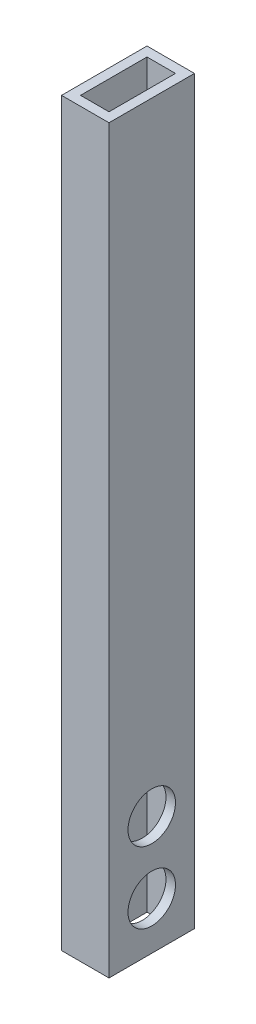
ISO-10303-21;
HEADER;
FILE_DESCRIPTION(('STEP AP214'),'2;1');
FILE_NAME('part.step','',(''),(''),'','','');
FILE_SCHEMA(('AUTOMOTIVE_DESIGN { 1 0 10303 214 1 1 1 1 }'));
ENDSEC;
DATA;
#1=APPLICATION_CONTEXT('core data for automotive mechanical design processes');
#2=APPLICATION_PROTOCOL_DEFINITION('international standard','automotive_design',2000,#1);
#3=PRODUCT_CONTEXT('',#1,'mechanical');
#4=PRODUCT('Part','Part','',(#3));
#5=PRODUCT_RELATED_PRODUCT_CATEGORY('part','',(#4));
#6=PRODUCT_DEFINITION_FORMATION('','',#4);
#7=PRODUCT_DEFINITION_CONTEXT('part definition',#1,'design');
#8=PRODUCT_DEFINITION('design','',#6,#7);
#9=PRODUCT_DEFINITION_SHAPE('','',#8);
#10=(LENGTH_UNIT() NAMED_UNIT(*) SI_UNIT(.MILLI.,.METRE.));
#11=(NAMED_UNIT(*) PLANE_ANGLE_UNIT() SI_UNIT($,.RADIAN.));
#12=(NAMED_UNIT(*) SI_UNIT($,.STERADIAN.) SOLID_ANGLE_UNIT());
#13=UNCERTAINTY_MEASURE_WITH_UNIT(LENGTH_MEASURE(1.E-05),#10,'distance_accuracy_value','');
#14=(GEOMETRIC_REPRESENTATION_CONTEXT(3) GLOBAL_UNCERTAINTY_ASSIGNED_CONTEXT((#13)) GLOBAL_UNIT_ASSIGNED_CONTEXT((#10,
#11,#12)) REPRESENTATION_CONTEXT('',''));
#15=CARTESIAN_POINT('',(0.,0.,0.));
#16=DIRECTION('',(0.,0.,1.));
#17=DIRECTION('',(1.,0.,0.));
#18=AXIS2_PLACEMENT_3D('',#15,#16,#17);
#19=CARTESIAN_POINT('',(0.,-125.,18.));
#20=DIRECTION('',(0.,1.,0.));
#21=DIRECTION('',(0.,0.,1.));
#22=AXIS2_PLACEMENT_3D('',#19,#20,#21);
#23=PLANE('',#22);
#24=DIRECTION('',(1.,0.,0.));
#25=VECTOR('',#24,1.);
#26=CARTESIAN_POINT('',(0.,-125.,0.));
#27=LINE('',#26,#25);
#28=CARTESIAN_POINT('',(-4.99999999999999,-125.,0.));
#29=VERTEX_POINT('',#28);
#30=CARTESIAN_POINT('',(5.00000000000001,-125.,0.));
#31=VERTEX_POINT('',#30);
#32=EDGE_CURVE('E123',#29,#31,#27,.T.);
#33=ORIENTED_EDGE('',*,*,#32,.T.);
#34=DIRECTION('',(0.,0.,-1.));
#35=VECTOR('',#34,1.);
#36=CARTESIAN_POINT('',(5.00000000000001,-125.,18.));
#37=LINE('',#36,#35);
#38=CARTESIAN_POINT('',(5.00000000000001,-125.,18.));
#39=VERTEX_POINT('',#38);
#40=EDGE_CURVE('E121',#39,#31,#37,.T.);
#41=ORIENTED_EDGE('',*,*,#40,.F.);
#42=DIRECTION('',(1.,0.,0.));
#43=VECTOR('',#42,1.);
#44=CARTESIAN_POINT('',(0.,-125.,18.));
#45=LINE('',#44,#43);
#46=CARTESIAN_POINT('',(-4.99999999999999,-125.,18.));
#47=VERTEX_POINT('',#46);
#48=EDGE_CURVE('E119',#47,#39,#45,.T.);
#49=ORIENTED_EDGE('',*,*,#48,.F.);
#50=DIRECTION('',(0.,0.,-1.));
#51=VECTOR('',#50,1.);
#52=CARTESIAN_POINT('',(-4.99999999999999,-125.,18.));
#53=LINE('',#52,#51);
#54=EDGE_CURVE('E45',#47,#29,#53,.T.);
#55=ORIENTED_EDGE('',*,*,#54,.T.);
#56=EDGE_LOOP('',(#33,#41,#49,#55));
#57=FACE_BOUND('',#56,.T.);
#58=DIRECTION('',(1.,0.,0.));
#59=VECTOR('',#58,1.);
#60=CARTESIAN_POINT('',(0.,-125.,2.));
#61=LINE('',#60,#59);
#62=CARTESIAN_POINT('',(-2.99999999999999,-125.,2.));
#63=VERTEX_POINT('',#62);
#64=CARTESIAN_POINT('',(3.00000000000001,-125.,2.));
#65=VERTEX_POINT('',#64);
#66=EDGE_CURVE('E173',#63,#65,#61,.T.);
#67=ORIENTED_EDGE('',*,*,#66,.F.);
#68=DIRECTION('',(0.,0.,-1.));
#69=VECTOR('',#68,1.);
#70=CARTESIAN_POINT('',(-2.99999999999999,-125.,18.));
#71=LINE('',#70,#69);
#72=CARTESIAN_POINT('',(-2.99999999999999,-125.,16.));
#73=VERTEX_POINT('',#72);
#74=EDGE_CURVE('E130',#73,#63,#71,.T.);
#75=ORIENTED_EDGE('',*,*,#74,.F.);
#76=DIRECTION('',(1.,0.,0.));
#77=VECTOR('',#76,1.);
#78=CARTESIAN_POINT('',(0.,-125.,16.));
#79=LINE('',#78,#77);
#80=CARTESIAN_POINT('',(3.00000000000001,-125.,16.));
#81=VERTEX_POINT('',#80);
#82=EDGE_CURVE('E175',#73,#81,#79,.T.);
#83=ORIENTED_EDGE('',*,*,#82,.T.);
#84=DIRECTION('',(0.,0.,-1.));
#85=VECTOR('',#84,1.);
#86=CARTESIAN_POINT('',(3.00000000000001,-125.,18.));
#87=LINE('',#86,#85);
#88=EDGE_CURVE('E177',#81,#65,#87,.T.);
#89=ORIENTED_EDGE('',*,*,#88,.T.);
#90=EDGE_LOOP('',(#67,#75,#83,#89));
#91=FACE_BOUND('',#90,.T.);
#92=ADVANCED_FACE('F37',(#57,#91),#23,.F.);
#93=CARTESIAN_POINT('',(5.,0.,18.));
#94=DIRECTION('',(1.,0.,0.));
#95=DIRECTION('',(0.,1.,0.));
#96=AXIS2_PLACEMENT_3D('',#93,#94,#95);
#97=PLANE('',#96);
#98=DIRECTION('',(0.,0.,-1.));
#99=VECTOR('',#98,1.);
#100=CARTESIAN_POINT('',(4.99999999999999,31.,18.));
#101=LINE('',#100,#99);
#102=CARTESIAN_POINT('',(4.99999999999999,31.,18.));
#103=VERTEX_POINT('',#102);
#104=CARTESIAN_POINT('',(4.99999999999999,31.,0.));
#105=VERTEX_POINT('',#104);
#106=EDGE_CURVE('E52',#103,#105,#101,.T.);
#107=ORIENTED_EDGE('',*,*,#106,.F.);
#108=DIRECTION('',(0.,-1.,0.));
#109=VECTOR('',#108,1.);
#110=CARTESIAN_POINT('',(5.,0.,18.));
#111=LINE('',#110,#109);
#112=EDGE_CURVE('E114',#103,#39,#111,.T.);
#113=ORIENTED_EDGE('',*,*,#112,.T.);
#114=ORIENTED_EDGE('',*,*,#40,.T.);
#115=DIRECTION('',(0.,-1.,0.));
#116=VECTOR('',#115,1.);
#117=CARTESIAN_POINT('',(5.,0.,0.));
#118=LINE('',#117,#116);
#119=EDGE_CURVE('E127',#105,#31,#118,.T.);
#120=ORIENTED_EDGE('',*,*,#119,.F.);
#121=EDGE_LOOP('',(#107,#113,#114,#120));
#122=FACE_BOUND('',#121,.T.);
#123=CARTESIAN_POINT('',(5.00000000000001,-115.,9.));
#124=DIRECTION('',(1.,0.,0.));
#125=DIRECTION('',(0.,1.,0.));
#126=AXIS2_PLACEMENT_3D('',#123,#124,#125);
#127=CIRCLE('',#126,5.00000000000001);
#128=CARTESIAN_POINT('',(5.00000000000001,-110.,9.));
#129=VERTEX_POINT('',#128);
#130=EDGE_CURVE('E151',#129,#129,#127,.T.);
#131=ORIENTED_EDGE('',*,*,#130,.F.);
#132=EDGE_LOOP('',(#131));
#133=FACE_BOUND('',#132,.T.);
#134=CARTESIAN_POINT('',(5.00000000000001,-100.,9.));
#135=DIRECTION('',(-1.,0.,0.));
#136=DIRECTION('',(0.,-1.,0.));
#137=AXIS2_PLACEMENT_3D('',#134,#135,#136);
#138=CIRCLE('',#137,5.);
#139=CARTESIAN_POINT('',(5.00000000000001,-105.,9.));
#140=VERTEX_POINT('',#139);
#141=EDGE_CURVE('E140',#140,#140,#138,.T.);
#142=ORIENTED_EDGE('',*,*,#141,.T.);
#143=EDGE_LOOP('',(#142));
#144=FACE_BOUND('',#143,.T.);
#145=ADVANCED_FACE('F39',(#122,#133,#144),#97,.T.);
#146=CARTESIAN_POINT('',(-5.,0.,18.));
#147=DIRECTION('',(1.,0.,0.));
#148=DIRECTION('',(0.,1.,0.));
#149=AXIS2_PLACEMENT_3D('',#146,#147,#148);
#150=PLANE('',#149);
#151=CARTESIAN_POINT('',(-4.99999999999999,-115.,9.));
#152=DIRECTION('',(1.,0.,0.));
#153=DIRECTION('',(0.,1.,0.));
#154=AXIS2_PLACEMENT_3D('',#151,#152,#153);
#155=CIRCLE('',#154,5.00000000000001);
#156=CARTESIAN_POINT('',(-4.99999999999999,-110.,9.));
#157=VERTEX_POINT('',#156);
#158=EDGE_CURVE('E144',#157,#157,#155,.T.);
#159=ORIENTED_EDGE('',*,*,#158,.T.);
#160=EDGE_LOOP('',(#159));
#161=FACE_BOUND('',#160,.T.);
#162=CARTESIAN_POINT('',(-4.99999999999999,-100.,9.));
#163=DIRECTION('',(-1.,0.,0.));
#164=DIRECTION('',(0.,-1.,0.));
#165=AXIS2_PLACEMENT_3D('',#162,#163,#164);
#166=CIRCLE('',#165,5.);
#167=CARTESIAN_POINT('',(-4.99999999999999,-105.,9.));
#168=VERTEX_POINT('',#167);
#169=EDGE_CURVE('E148',#168,#168,#166,.T.);
#170=ORIENTED_EDGE('',*,*,#169,.F.);
#171=EDGE_LOOP('',(#170));
#172=FACE_BOUND('',#171,.T.);
#173=DIRECTION('',(0.,-1.,0.));
#174=VECTOR('',#173,1.);
#175=CARTESIAN_POINT('',(-5.,0.,18.));
#176=LINE('',#175,#174);
#177=CARTESIAN_POINT('',(-5.00000000000001,31.,18.));
#178=VERTEX_POINT('',#177);
#179=EDGE_CURVE('E112',#178,#47,#176,.T.);
#180=ORIENTED_EDGE('',*,*,#179,.F.);
#181=DIRECTION('',(0.,0.,-1.));
#182=VECTOR('',#181,1.);
#183=CARTESIAN_POINT('',(-5.00000000000001,31.,18.));
#184=LINE('',#183,#182);
#185=CARTESIAN_POINT('',(-5.00000000000001,31.,0.));
#186=VERTEX_POINT('',#185);
#187=EDGE_CURVE('E99',#178,#186,#184,.T.);
#188=ORIENTED_EDGE('',*,*,#187,.T.);
#189=DIRECTION('',(0.,-1.,0.));
#190=VECTOR('',#189,1.);
#191=CARTESIAN_POINT('',(-5.,0.,0.));
#192=LINE('',#191,#190);
#193=EDGE_CURVE('E129',#186,#29,#192,.T.);
#194=ORIENTED_EDGE('',*,*,#193,.T.);
#195=ORIENTED_EDGE('',*,*,#54,.F.);
#196=EDGE_LOOP('',(#180,#188,#194,#195));
#197=FACE_BOUND('',#196,.T.);
#198=ADVANCED_FACE('F116',(#161,#172,#197),#150,.F.);
#199=CARTESIAN_POINT('',(0.,0.,18.));
#200=DIRECTION('',(0.,0.,1.));
#201=DIRECTION('',(1.,0.,0.));
#202=AXIS2_PLACEMENT_3D('',#199,#200,#201);
#203=PLANE('',#202);
#204=DIRECTION('',(1.,0.,0.));
#205=VECTOR('',#204,1.);
#206=CARTESIAN_POINT('',(-5.00000000000001,31.,18.));
#207=LINE('',#206,#205);
#208=EDGE_CURVE('E102',#178,#103,#207,.T.);
#209=ORIENTED_EDGE('',*,*,#208,.F.);
#210=ORIENTED_EDGE('',*,*,#179,.T.);
#211=ORIENTED_EDGE('',*,*,#48,.T.);
#212=ORIENTED_EDGE('',*,*,#112,.F.);
#213=EDGE_LOOP('',(#209,#210,#211,#212));
#214=FACE_BOUND('',#213,.T.);
#215=ADVANCED_FACE('F110',(#214),#203,.T.);
#216=CARTESIAN_POINT('',(0.,0.,0.));
#217=DIRECTION('',(0.,0.,1.));
#218=DIRECTION('',(1.,0.,0.));
#219=AXIS2_PLACEMENT_3D('',#216,#217,#218);
#220=PLANE('',#219);
#221=ORIENTED_EDGE('',*,*,#193,.F.);
#222=DIRECTION('',(1.,0.,0.));
#223=VECTOR('',#222,1.);
#224=CARTESIAN_POINT('',(-5.00000000000001,31.,0.));
#225=LINE('',#224,#223);
#226=EDGE_CURVE('E103',#186,#105,#225,.T.);
#227=ORIENTED_EDGE('',*,*,#226,.T.);
#228=ORIENTED_EDGE('',*,*,#119,.T.);
#229=ORIENTED_EDGE('',*,*,#32,.F.);
#230=EDGE_LOOP('',(#221,#227,#228,#229));
#231=FACE_BOUND('',#230,.T.);
#232=ADVANCED_FACE('F204',(#231),#220,.F.);
#233=CARTESIAN_POINT('',(3.,0.,18.));
#234=DIRECTION('',(1.,0.,0.));
#235=DIRECTION('',(0.,1.,0.));
#236=AXIS2_PLACEMENT_3D('',#233,#234,#235);
#237=PLANE('',#236);
#238=CARTESIAN_POINT('',(3.00000000000001,-115.,9.));
#239=DIRECTION('',(1.,0.,0.));
#240=DIRECTION('',(0.,1.,0.));
#241=AXIS2_PLACEMENT_3D('',#238,#239,#240);
#242=CIRCLE('',#241,5.00000000000001);
#243=CARTESIAN_POINT('',(3.00000000000001,-110.,9.));
#244=VERTEX_POINT('',#243);
#245=EDGE_CURVE('E143',#244,#244,#242,.T.);
#246=ORIENTED_EDGE('',*,*,#245,.T.);
#247=EDGE_LOOP('',(#246));
#248=FACE_BOUND('',#247,.T.);
#249=CARTESIAN_POINT('',(3.00000000000001,-100.,9.));
#250=DIRECTION('',(1.,0.,0.));
#251=DIRECTION('',(0.,1.,0.));
#252=AXIS2_PLACEMENT_3D('',#249,#250,#251);
#253=CIRCLE('',#252,5.);
#254=CARTESIAN_POINT('',(3.00000000000001,-95.,9.));
#255=VERTEX_POINT('',#254);
#256=EDGE_CURVE('E139',#255,#255,#253,.T.);
#257=ORIENTED_EDGE('',*,*,#256,.T.);
#258=EDGE_LOOP('',(#257));
#259=FACE_BOUND('',#258,.T.);
#260=DIRECTION('',(0.,-1.,0.));
#261=VECTOR('',#260,1.);
#262=CARTESIAN_POINT('',(3.,0.,16.));
#263=LINE('',#262,#261);
#264=CARTESIAN_POINT('',(2.99999999999999,31.,16.));
#265=VERTEX_POINT('',#264);
#266=EDGE_CURVE('E170',#265,#81,#263,.T.);
#267=ORIENTED_EDGE('',*,*,#266,.F.);
#268=DIRECTION('',(0.,0.,-1.));
#269=VECTOR('',#268,1.);
#270=CARTESIAN_POINT('',(2.99999999999999,31.,18.));
#271=LINE('',#270,#269);
#272=CARTESIAN_POINT('',(3.00000000000001,31.,2.));
#273=VERTEX_POINT('',#272);
#274=EDGE_CURVE('E197',#265,#273,#271,.T.);
#275=ORIENTED_EDGE('',*,*,#274,.T.);
#276=DIRECTION('',(0.,-1.,0.));
#277=VECTOR('',#276,1.);
#278=CARTESIAN_POINT('',(3.,0.,2.));
#279=LINE('',#278,#277);
#280=EDGE_CURVE('E167',#273,#65,#279,.T.);
#281=ORIENTED_EDGE('',*,*,#280,.T.);
#282=ORIENTED_EDGE('',*,*,#88,.F.);
#283=EDGE_LOOP('',(#267,#275,#281,#282));
#284=FACE_BOUND('',#283,.T.);
#285=ADVANCED_FACE('F195',(#248,#259,#284),#237,.F.);
#286=CARTESIAN_POINT('',(-3.,0.,18.));
#287=DIRECTION('',(1.,0.,0.));
#288=DIRECTION('',(0.,1.,0.));
#289=AXIS2_PLACEMENT_3D('',#286,#287,#288);
#290=PLANE('',#289);
#291=DIRECTION('',(0.,0.,-1.));
#292=VECTOR('',#291,1.);
#293=CARTESIAN_POINT('',(-3.00000000000001,31.,18.));
#294=LINE('',#293,#292);
#295=CARTESIAN_POINT('',(-3.00000000000001,31.,16.));
#296=VERTEX_POINT('',#295);
#297=CARTESIAN_POINT('',(-3.00000000000001,31.,2.));
#298=VERTEX_POINT('',#297);
#299=EDGE_CURVE('E59',#296,#298,#294,.T.);
#300=ORIENTED_EDGE('',*,*,#299,.F.);
#301=DIRECTION('',(0.,-1.,0.));
#302=VECTOR('',#301,1.);
#303=CARTESIAN_POINT('',(-3.,0.,16.));
#304=LINE('',#303,#302);
#305=EDGE_CURVE('E172',#296,#73,#304,.T.);
#306=ORIENTED_EDGE('',*,*,#305,.T.);
#307=ORIENTED_EDGE('',*,*,#74,.T.);
#308=DIRECTION('',(0.,-1.,0.));
#309=VECTOR('',#308,1.);
#310=CARTESIAN_POINT('',(-3.,0.,2.));
#311=LINE('',#310,#309);
#312=EDGE_CURVE('E169',#298,#63,#311,.T.);
#313=ORIENTED_EDGE('',*,*,#312,.F.);
#314=EDGE_LOOP('',(#300,#306,#307,#313));
#315=FACE_BOUND('',#314,.T.);
#316=CARTESIAN_POINT('',(-2.99999999999999,-115.,9.));
#317=DIRECTION('',(1.,0.,0.));
#318=DIRECTION('',(0.,1.,0.));
#319=AXIS2_PLACEMENT_3D('',#316,#317,#318);
#320=CIRCLE('',#319,5.00000000000001);
#321=CARTESIAN_POINT('',(-2.99999999999999,-110.,9.));
#322=VERTEX_POINT('',#321);
#323=EDGE_CURVE('E141',#322,#322,#320,.T.);
#324=ORIENTED_EDGE('',*,*,#323,.F.);
#325=EDGE_LOOP('',(#324));
#326=FACE_BOUND('',#325,.T.);
#327=CARTESIAN_POINT('',(-2.99999999999999,-100.,9.));
#328=DIRECTION('',(1.,0.,0.));
#329=DIRECTION('',(0.,1.,0.));
#330=AXIS2_PLACEMENT_3D('',#327,#328,#329);
#331=CIRCLE('',#330,5.);
#332=CARTESIAN_POINT('',(-2.99999999999999,-95.,9.));
#333=VERTEX_POINT('',#332);
#334=EDGE_CURVE('E137',#333,#333,#331,.T.);
#335=ORIENTED_EDGE('',*,*,#334,.F.);
#336=EDGE_LOOP('',(#335));
#337=FACE_BOUND('',#336,.T.);
#338=ADVANCED_FACE('F242',(#315,#326,#337),#290,.T.);
#339=CARTESIAN_POINT('',(0.,0.,16.));
#340=DIRECTION('',(0.,0.,1.));
#341=DIRECTION('',(1.,0.,0.));
#342=AXIS2_PLACEMENT_3D('',#339,#340,#341);
#343=PLANE('',#342);
#344=ORIENTED_EDGE('',*,*,#305,.F.);
#345=DIRECTION('',(1.,0.,0.));
#346=VECTOR('',#345,1.);
#347=CARTESIAN_POINT('',(0.,31.,16.));
#348=LINE('',#347,#346);
#349=EDGE_CURVE('E156',#296,#265,#348,.T.);
#350=ORIENTED_EDGE('',*,*,#349,.T.);
#351=ORIENTED_EDGE('',*,*,#266,.T.);
#352=ORIENTED_EDGE('',*,*,#82,.F.);
#353=EDGE_LOOP('',(#344,#350,#351,#352));
#354=FACE_BOUND('',#353,.T.);
#355=ADVANCED_FACE('F235',(#354),#343,.F.);
#356=CARTESIAN_POINT('',(0.,0.,2.));
#357=DIRECTION('',(0.,0.,1.));
#358=DIRECTION('',(1.,0.,0.));
#359=AXIS2_PLACEMENT_3D('',#356,#357,#358);
#360=PLANE('',#359);
#361=DIRECTION('',(1.,0.,0.));
#362=VECTOR('',#361,1.);
#363=CARTESIAN_POINT('',(0.,31.,2.));
#364=LINE('',#363,#362);
#365=EDGE_CURVE('E11',#298,#273,#364,.T.);
#366=ORIENTED_EDGE('',*,*,#365,.F.);
#367=ORIENTED_EDGE('',*,*,#312,.T.);
#368=ORIENTED_EDGE('',*,*,#66,.T.);
#369=ORIENTED_EDGE('',*,*,#280,.F.);
#370=EDGE_LOOP('',(#366,#367,#368,#369));
#371=FACE_BOUND('',#370,.T.);
#372=ADVANCED_FACE('F187',(#371),#360,.T.);
#373=CARTESIAN_POINT('',(5.00000000000001,-100.,9.));
#374=DIRECTION('',(-1.,0.,0.));
#375=DIRECTION('',(0.,-1.,0.));
#376=AXIS2_PLACEMENT_3D('',#373,#374,#375);
#377=CYLINDRICAL_SURFACE('',#376,5.);
#378=ORIENTED_EDGE('',*,*,#334,.T.);
#379=EDGE_LOOP('',(#378));
#380=FACE_BOUND('',#379,.T.);
#381=ORIENTED_EDGE('',*,*,#169,.T.);
#382=EDGE_LOOP('',(#381));
#383=FACE_BOUND('',#382,.T.);
#384=ADVANCED_FACE('F224',(#380,#383),#377,.F.);
#385=ORIENTED_EDGE('',*,*,#141,.F.);
#386=EDGE_LOOP('',(#385));
#387=FACE_BOUND('',#386,.T.);
#388=ORIENTED_EDGE('',*,*,#256,.F.);
#389=EDGE_LOOP('',(#388));
#390=FACE_BOUND('',#389,.T.);
#391=ADVANCED_FACE('F226',(#387,#390),#377,.F.);
#392=CARTESIAN_POINT('',(-4.99999999999999,-115.,9.));
#393=DIRECTION('',(1.,0.,0.));
#394=DIRECTION('',(0.,1.,0.));
#395=AXIS2_PLACEMENT_3D('',#392,#393,#394);
#396=CYLINDRICAL_SURFACE('',#395,5.00000000000001);
#397=ORIENTED_EDGE('',*,*,#323,.T.);
#398=EDGE_LOOP('',(#397));
#399=FACE_BOUND('',#398,.T.);
#400=ORIENTED_EDGE('',*,*,#158,.F.);
#401=EDGE_LOOP('',(#400));
#402=FACE_BOUND('',#401,.T.);
#403=ADVANCED_FACE('F233',(#399,#402),#396,.F.);
#404=ORIENTED_EDGE('',*,*,#130,.T.);
#405=EDGE_LOOP('',(#404));
#406=FACE_BOUND('',#405,.T.);
#407=ORIENTED_EDGE('',*,*,#245,.F.);
#408=EDGE_LOOP('',(#407));
#409=FACE_BOUND('',#408,.T.);
#410=ADVANCED_FACE('F256',(#406,#409),#396,.F.);
#411=CARTESIAN_POINT('',(-5.00000000000001,31.,18.));
#412=DIRECTION('',(0.,-1.,0.));
#413=DIRECTION('',(1.,0.,0.));
#414=AXIS2_PLACEMENT_3D('',#411,#412,#413);
#415=PLANE('',#414);
#416=ORIENTED_EDGE('',*,*,#106,.T.);
#417=ORIENTED_EDGE('',*,*,#226,.F.);
#418=ORIENTED_EDGE('',*,*,#187,.F.);
#419=ORIENTED_EDGE('',*,*,#208,.T.);
#420=EDGE_LOOP('',(#416,#417,#418,#419));
#421=FACE_BOUND('',#420,.T.);
#422=ORIENTED_EDGE('',*,*,#299,.T.);
#423=ORIENTED_EDGE('',*,*,#365,.T.);
#424=ORIENTED_EDGE('',*,*,#274,.F.);
#425=ORIENTED_EDGE('',*,*,#349,.F.);
#426=EDGE_LOOP('',(#422,#423,#424,#425));
#427=FACE_BOUND('',#426,.T.);
#428=ADVANCED_FACE('F101',(#421,#427),#415,.F.);
#429=CLOSED_SHELL('',(#92,#145,#198,#215,#232,#285,#338,#355,#372,#384,#391,#403,#410,#428));
#430=MANIFOLD_SOLID_BREP('B2',#429);
#431=ADVANCED_BREP_SHAPE_REPRESENTATION('',(#18,#430),#14);
#432=SHAPE_DEFINITION_REPRESENTATION(#9,#431);
ENDSEC;
END-ISO-10303-21;
